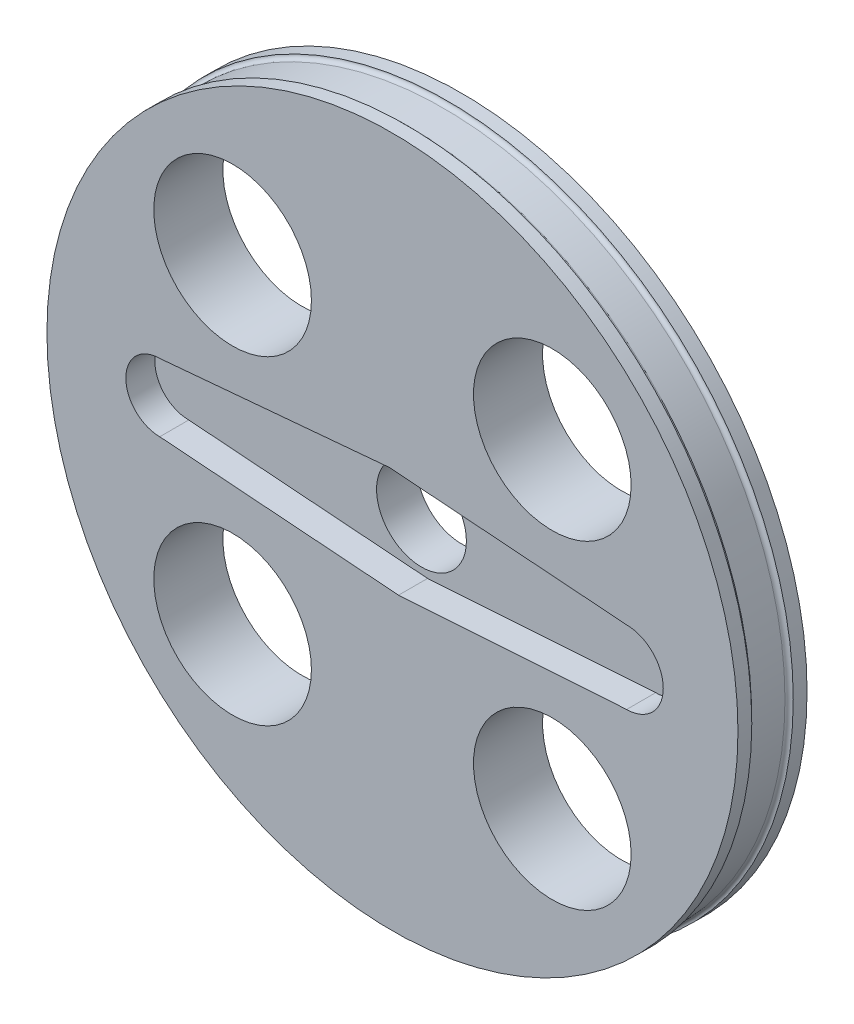
ISO-10303-21;
HEADER;
FILE_DESCRIPTION(('STEP AP214'),'2;1');
FILE_NAME('part.step','',(''),(''),'','','');
FILE_SCHEMA(('AUTOMOTIVE_DESIGN { 1 0 10303 214 1 1 1 1 }'));
ENDSEC;
DATA;
#1=APPLICATION_CONTEXT('core data for automotive mechanical design processes');
#2=APPLICATION_PROTOCOL_DEFINITION('international standard','automotive_design',2000,#1);
#3=PRODUCT_CONTEXT('',#1,'mechanical');
#4=PRODUCT('Part','Part','',(#3));
#5=PRODUCT_RELATED_PRODUCT_CATEGORY('part','',(#4));
#6=PRODUCT_DEFINITION_FORMATION('','',#4);
#7=PRODUCT_DEFINITION_CONTEXT('part definition',#1,'design');
#8=PRODUCT_DEFINITION('design','',#6,#7);
#9=PRODUCT_DEFINITION_SHAPE('','',#8);
#10=(LENGTH_UNIT() NAMED_UNIT(*) SI_UNIT(.MILLI.,.METRE.));
#11=(NAMED_UNIT(*) PLANE_ANGLE_UNIT() SI_UNIT($,.RADIAN.));
#12=(NAMED_UNIT(*) SI_UNIT($,.STERADIAN.) SOLID_ANGLE_UNIT());
#13=UNCERTAINTY_MEASURE_WITH_UNIT(LENGTH_MEASURE(1.E-05),#10,'distance_accuracy_value','');
#14=(GEOMETRIC_REPRESENTATION_CONTEXT(3) GLOBAL_UNCERTAINTY_ASSIGNED_CONTEXT((#13)) GLOBAL_UNIT_ASSIGNED_CONTEXT((#10,
#11,#12)) REPRESENTATION_CONTEXT('',''));
#15=CARTESIAN_POINT('',(0.,0.,0.));
#16=DIRECTION('',(0.,0.,1.));
#17=DIRECTION('',(1.,0.,0.));
#18=AXIS2_PLACEMENT_3D('',#15,#16,#17);
#19=CARTESIAN_POINT('',(-38.3080889759632,20.9098318993799,5.));
#20=DIRECTION('',(0.,0.,-1.));
#21=DIRECTION('',(-1.,0.,0.));
#22=AXIS2_PLACEMENT_3D('',#19,#20,#21);
#23=CYLINDRICAL_SURFACE('',#22,25.);
#24=CARTESIAN_POINT('',(-38.3080889759632,20.9098318993799,0.));
#25=DIRECTION('',(0.,0.,1.));
#26=DIRECTION('',(1.,0.,0.));
#27=AXIS2_PLACEMENT_3D('',#24,#25,#26);
#28=CIRCLE('',#27,25.);
#29=CARTESIAN_POINT('',(-13.3080889759632,20.9098318993799,0.));
#30=VERTEX_POINT('',#29);
#31=EDGE_CURVE('E147',#30,#30,#28,.T.);
#32=ORIENTED_EDGE('',*,*,#31,.T.);
#33=EDGE_LOOP('',(#32));
#34=FACE_BOUND('',#33,.T.);
#35=CARTESIAN_POINT('',(-38.3080889759632,20.9098318993799,1.));
#36=DIRECTION('',(0.,0.,-1.));
#37=DIRECTION('',(-1.,0.,0.));
#38=AXIS2_PLACEMENT_3D('',#35,#36,#37);
#39=CIRCLE('',#38,25.);
#40=CARTESIAN_POINT('',(-63.3080889759632,20.9098318993799,1.));
#41=VERTEX_POINT('',#40);
#42=EDGE_CURVE('E144',#41,#41,#39,.T.);
#43=ORIENTED_EDGE('',*,*,#42,.T.);
#44=EDGE_LOOP('',(#43));
#45=FACE_BOUND('',#44,.T.);
#46=ADVANCED_FACE('F33',(#34,#45),#23,.T.);
#47=CARTESIAN_POINT('',(-38.3080889759632,20.9098318993799,0.));
#48=DIRECTION('',(0.,0.,1.));
#49=DIRECTION('',(1.,0.,0.));
#50=AXIS2_PLACEMENT_3D('',#47,#48,#49);
#51=PLANE('',#50);
#52=CARTESIAN_POINT('',(-49.8736031515212,32.4753460749378,0.));
#53=DIRECTION('',(0.,0.,1.));
#54=DIRECTION('',(1.,0.,0.));
#55=AXIS2_PLACEMENT_3D('',#52,#53,#54);
#56=CIRCLE('',#55,5.70244776858911);
#57=CARTESIAN_POINT('',(-44.1711553829321,32.4753460749378,0.));
#58=VERTEX_POINT('',#57);
#59=EDGE_CURVE('E241',#58,#58,#56,.T.);
#60=ORIENTED_EDGE('',*,*,#59,.T.);
#61=EDGE_LOOP('',(#60));
#62=FACE_BOUND('',#61,.T.);
#63=CARTESIAN_POINT('',(-49.873603151521,9.34431772382153,0.));
#64=DIRECTION('',(0.,0.,1.));
#65=DIRECTION('',(1.,0.,0.));
#66=AXIS2_PLACEMENT_3D('',#63,#64,#65);
#67=CIRCLE('',#66,5.70244776858912);
#68=CARTESIAN_POINT('',(-44.1711553829319,9.34431772382153,0.));
#69=VERTEX_POINT('',#68);
#70=EDGE_CURVE('E245',#69,#69,#67,.T.);
#71=ORIENTED_EDGE('',*,*,#70,.T.);
#72=EDGE_LOOP('',(#71));
#73=FACE_BOUND('',#72,.T.);
#74=CARTESIAN_POINT('',(-26.7425748004048,9.34431772382177,0.));
#75=DIRECTION('',(0.,0.,1.));
#76=DIRECTION('',(1.,0.,0.));
#77=AXIS2_PLACEMENT_3D('',#74,#75,#76);
#78=CIRCLE('',#77,5.70244776858911);
#79=CARTESIAN_POINT('',(-21.0401270318156,9.34431772382177,0.));
#80=VERTEX_POINT('',#79);
#81=EDGE_CURVE('E254',#80,#80,#78,.T.);
#82=ORIENTED_EDGE('',*,*,#81,.T.);
#83=EDGE_LOOP('',(#82));
#84=FACE_BOUND('',#83,.T.);
#85=CARTESIAN_POINT('',(-26.7425748004051,32.475346074938,0.));
#86=DIRECTION('',(0.,0.,1.));
#87=DIRECTION('',(1.,0.,0.));
#88=AXIS2_PLACEMENT_3D('',#85,#86,#87);
#89=CIRCLE('',#88,5.70244776858911);
#90=CARTESIAN_POINT('',(-21.040127031816,32.475346074938,0.));
#91=VERTEX_POINT('',#90);
#92=EDGE_CURVE('E260',#91,#91,#89,.T.);
#93=ORIENTED_EDGE('',*,*,#92,.T.);
#94=EDGE_LOOP('',(#93));
#95=FACE_BOUND('',#94,.T.);
#96=CARTESIAN_POINT('',(-38.3080889759632,20.9098318993799,0.));
#97=DIRECTION('',(0.,0.,1.));
#98=DIRECTION('',(1.,0.,0.));
#99=AXIS2_PLACEMENT_3D('',#96,#97,#98);
#100=CIRCLE('',#99,3.25);
#101=CARTESIAN_POINT('',(-35.0580889759632,20.9098318993799,0.));
#102=VERTEX_POINT('',#101);
#103=EDGE_CURVE('E123',#102,#102,#100,.T.);
#104=ORIENTED_EDGE('',*,*,#103,.T.);
#105=EDGE_LOOP('',(#104));
#106=FACE_BOUND('',#105,.T.);
#107=ORIENTED_EDGE('',*,*,#31,.F.);
#108=EDGE_LOOP('',(#107));
#109=FACE_BOUND('',#108,.T.);
#110=ADVANCED_FACE('F164',(#62,#73,#84,#95,#106,#109),#51,.F.);
#111=CARTESIAN_POINT('',(-38.3080889759632,20.9098318993799,0.));
#112=DIRECTION('',(0.,0.,-1.));
#113=DIRECTION('',(-1.,0.,0.));
#114=AXIS2_PLACEMENT_3D('',#111,#112,#113);
#115=CYLINDRICAL_SURFACE('',#114,24.7);
#116=CARTESIAN_POINT('',(-38.3080889759632,20.9098318993799,3.7));
#117=DIRECTION('',(0.,0.,-1.));
#118=DIRECTION('',(-1.,0.,0.));
#119=AXIS2_PLACEMENT_3D('',#116,#117,#118);
#120=CIRCLE('',#119,24.7);
#121=CARTESIAN_POINT('',(-63.0080889759632,20.9098318993799,3.7));
#122=VERTEX_POINT('',#121);
#123=EDGE_CURVE('E11',#122,#122,#120,.T.);
#124=ORIENTED_EDGE('',*,*,#123,.T.);
#125=EDGE_LOOP('',(#124));
#126=FACE_BOUND('',#125,.T.);
#127=CARTESIAN_POINT('',(-38.3080889759632,20.9098318993799,1.3));
#128=DIRECTION('',(0.,0.,1.));
#129=DIRECTION('',(1.,0.,0.));
#130=AXIS2_PLACEMENT_3D('',#127,#128,#129);
#131=CIRCLE('',#130,24.7);
#132=CARTESIAN_POINT('',(-13.6080889759632,20.9098318993799,1.3));
#133=VERTEX_POINT('',#132);
#134=EDGE_CURVE('E41',#133,#133,#131,.T.);
#135=ORIENTED_EDGE('',*,*,#134,.T.);
#136=EDGE_LOOP('',(#135));
#137=FACE_BOUND('',#136,.T.);
#138=ADVANCED_FACE('F155',(#126,#137),#115,.T.);
#139=CARTESIAN_POINT('',(-38.3080889759632,20.9098318993799,5.));
#140=DIRECTION('',(0.,0.,1.));
#141=DIRECTION('',(1.,0.,0.));
#142=AXIS2_PLACEMENT_3D('',#139,#140,#141);
#143=PLANE('',#142);
#144=CARTESIAN_POINT('',(-49.8736031515212,32.4753460749378,5.));
#145=DIRECTION('',(0.,0.,1.));
#146=DIRECTION('',(1.,0.,0.));
#147=AXIS2_PLACEMENT_3D('',#144,#145,#146);
#148=CIRCLE('',#147,5.70244776858911);
#149=CARTESIAN_POINT('',(-44.1711553829321,32.4753460749378,5.));
#150=VERTEX_POINT('',#149);
#151=EDGE_CURVE('E238',#150,#150,#148,.T.);
#152=ORIENTED_EDGE('',*,*,#151,.F.);
#153=EDGE_LOOP('',(#152));
#154=FACE_BOUND('',#153,.T.);
#155=CARTESIAN_POINT('',(-49.873603151521,9.34431772382153,5.));
#156=DIRECTION('',(0.,0.,1.));
#157=DIRECTION('',(1.,0.,0.));
#158=AXIS2_PLACEMENT_3D('',#155,#156,#157);
#159=CIRCLE('',#158,5.70244776858912);
#160=CARTESIAN_POINT('',(-44.1711553829319,9.34431772382153,5.));
#161=VERTEX_POINT('',#160);
#162=EDGE_CURVE('E242',#161,#161,#159,.T.);
#163=ORIENTED_EDGE('',*,*,#162,.F.);
#164=EDGE_LOOP('',(#163));
#165=FACE_BOUND('',#164,.T.);
#166=CARTESIAN_POINT('',(-26.7425748004048,9.34431772382177,5.));
#167=DIRECTION('',(0.,0.,1.));
#168=DIRECTION('',(1.,0.,0.));
#169=AXIS2_PLACEMENT_3D('',#166,#167,#168);
#170=CIRCLE('',#169,5.70244776858911);
#171=CARTESIAN_POINT('',(-21.0401270318156,9.34431772382177,5.));
#172=VERTEX_POINT('',#171);
#173=EDGE_CURVE('E251',#172,#172,#170,.T.);
#174=ORIENTED_EDGE('',*,*,#173,.F.);
#175=EDGE_LOOP('',(#174));
#176=FACE_BOUND('',#175,.T.);
#177=CARTESIAN_POINT('',(-26.7425748004051,32.475346074938,5.));
#178=DIRECTION('',(0.,0.,1.));
#179=DIRECTION('',(1.,0.,0.));
#180=AXIS2_PLACEMENT_3D('',#177,#178,#179);
#181=CIRCLE('',#180,5.70244776858911);
#182=CARTESIAN_POINT('',(-21.040127031816,32.475346074938,5.));
#183=VERTEX_POINT('',#182);
#184=EDGE_CURVE('E257',#183,#183,#181,.T.);
#185=ORIENTED_EDGE('',*,*,#184,.F.);
#186=EDGE_LOOP('',(#185));
#187=FACE_BOUND('',#186,.T.);
#188=DIRECTION('',(-0.997236005662708,0.0742990512044924,0.));
#189=VECTOR('',#188,1.);
#190=CARTESIAN_POINT('',(-38.5378408043727,24.8394002818716,5.));
#191=LINE('',#190,#189);
#192=CARTESIAN_POINT('',(-21.3635748878897,23.5598318993799,5.));
#193=VERTEX_POINT('',#192);
#194=CARTESIAN_POINT('',(-38.5378408043727,24.8394002818716,5.));
#195=VERTEX_POINT('',#194);
#196=EDGE_CURVE('E48',#193,#195,#191,.T.);
#197=ORIENTED_EDGE('',*,*,#196,.F.);
#198=CARTESIAN_POINT('',(-21.3635748878897,20.9098318993799,5.));
#199=DIRECTION('',(0.,0.,1.));
#200=DIRECTION('',(1.,0.,0.));
#201=AXIS2_PLACEMENT_3D('',#198,#199,#200);
#202=CIRCLE('',#201,2.65);
#203=CARTESIAN_POINT('',(-21.3635748878897,18.2598318993799,5.));
#204=VERTEX_POINT('',#203);
#205=EDGE_CURVE('E132',#204,#193,#202,.T.);
#206=ORIENTED_EDGE('',*,*,#205,.F.);
#207=DIRECTION('',(0.997821412135131,0.0659729450960975,0.));
#208=VECTOR('',#207,1.);
#209=CARTESIAN_POINT('',(-37.8671567397895,17.1686647965668,5.));
#210=LINE('',#209,#208);
#211=CARTESIAN_POINT('',(-37.8671567397895,17.1686647965668,5.));
#212=VERTEX_POINT('',#211);
#213=EDGE_CURVE('E130',#212,#204,#210,.T.);
#214=ORIENTED_EDGE('',*,*,#213,.F.);
#215=DIRECTION('',(0.997236005662708,-0.0742990512044923,0.));
#216=VECTOR('',#215,1.);
#217=CARTESIAN_POINT('',(-37.8671567397895,17.1686647965668,5.));
#218=LINE('',#217,#216);
#219=CARTESIAN_POINT('',(-55.1454005986455,18.4559800538411,5.));
#220=VERTEX_POINT('',#219);
#221=EDGE_CURVE('E96',#220,#212,#218,.T.);
#222=ORIENTED_EDGE('',*,*,#221,.F.);
#223=CARTESIAN_POINT('',(-55.1454005986455,20.9098318993799,5.));
#224=DIRECTION('',(0.,0.,1.));
#225=DIRECTION('',(-1.,0.,0.));
#226=AXIS2_PLACEMENT_3D('',#223,#224,#225);
#227=CIRCLE('',#226,2.4538518455388);
#228=CARTESIAN_POINT('',(-55.1454005986455,23.3636837449187,5.));
#229=VERTEX_POINT('',#228);
#230=EDGE_CURVE('E126',#229,#220,#227,.T.);
#231=ORIENTED_EDGE('',*,*,#230,.F.);
#232=DIRECTION('',(-0.996075343172449,-0.0885093821235284,0.));
#233=VECTOR('',#232,1.);
#234=CARTESIAN_POINT('',(-38.5378408043727,24.8394002818716,5.));
#235=LINE('',#234,#233);
#236=EDGE_CURVE('E122',#195,#229,#235,.T.);
#237=ORIENTED_EDGE('',*,*,#236,.F.);
#238=EDGE_LOOP('',(#197,#206,#214,#222,#231,#237));
#239=FACE_BOUND('',#238,.T.);
#240=CARTESIAN_POINT('',(-38.3080889759632,20.9098318993799,5.));
#241=DIRECTION('',(0.,0.,1.));
#242=DIRECTION('',(1.,0.,0.));
#243=AXIS2_PLACEMENT_3D('',#240,#241,#242);
#244=CIRCLE('',#243,25.);
#245=CARTESIAN_POINT('',(-13.3080889759632,20.9098318993799,5.));
#246=VERTEX_POINT('',#245);
#247=EDGE_CURVE('E148',#246,#246,#244,.T.);
#248=ORIENTED_EDGE('',*,*,#247,.T.);
#249=EDGE_LOOP('',(#248));
#250=FACE_BOUND('',#249,.T.);
#251=ADVANCED_FACE('F174',(#154,#165,#176,#187,#239,#250),#143,.T.);
#252=ORIENTED_EDGE('',*,*,#247,.F.);
#253=EDGE_LOOP('',(#252));
#254=FACE_BOUND('',#253,.T.);
#255=CARTESIAN_POINT('',(-38.3080889759632,20.9098318993799,4.));
#256=DIRECTION('',(0.,0.,-1.));
#257=DIRECTION('',(-1.,0.,0.));
#258=AXIS2_PLACEMENT_3D('',#255,#256,#257);
#259=CIRCLE('',#258,25.);
#260=CARTESIAN_POINT('',(-63.3080889759632,20.9098318993799,4.));
#261=VERTEX_POINT('',#260);
#262=EDGE_CURVE('E136',#261,#261,#259,.T.);
#263=ORIENTED_EDGE('',*,*,#262,.F.);
#264=EDGE_LOOP('',(#263));
#265=FACE_BOUND('',#264,.T.);
#266=ADVANCED_FACE('F167',(#254,#265),#23,.T.);
#267=CARTESIAN_POINT('',(-38.3080889759632,20.9098318993799,3.7));
#268=DIRECTION('',(0.,0.,-1.));
#269=DIRECTION('',(-1.,0.,0.));
#270=AXIS2_PLACEMENT_3D('',#267,#268,#269);
#271=TOROIDAL_SURFACE('',#270,25.,0.3);
#272=ORIENTED_EDGE('',*,*,#262,.T.);
#273=EDGE_LOOP('',(#272));
#274=FACE_BOUND('',#273,.T.);
#275=ORIENTED_EDGE('',*,*,#123,.F.);
#276=EDGE_LOOP('',(#275));
#277=FACE_BOUND('',#276,.T.);
#278=ADVANCED_FACE('F160',(#274,#277),#271,.F.);
#279=CARTESIAN_POINT('',(-38.3080889759632,20.9098318993799,1.3));
#280=DIRECTION('',(0.,0.,1.));
#281=DIRECTION('',(1.,0.,0.));
#282=AXIS2_PLACEMENT_3D('',#279,#280,#281);
#283=TOROIDAL_SURFACE('',#282,25.,0.3);
#284=ORIENTED_EDGE('',*,*,#134,.F.);
#285=EDGE_LOOP('',(#284));
#286=FACE_BOUND('',#285,.T.);
#287=ORIENTED_EDGE('',*,*,#42,.F.);
#288=EDGE_LOOP('',(#287));
#289=FACE_BOUND('',#288,.T.);
#290=ADVANCED_FACE('F35',(#286,#289),#283,.F.);
#291=CARTESIAN_POINT('',(-38.5378408043727,24.8394002818716,2.9));
#292=DIRECTION('',(0.0742990512044924,0.997236005662708,0.));
#293=DIRECTION('',(-0.997236005662708,0.0742990512044924,0.));
#294=AXIS2_PLACEMENT_3D('',#291,#292,#293);
#295=PLANE('',#294);
#296=ORIENTED_EDGE('',*,*,#196,.T.);
#297=DIRECTION('',(0.,0.,1.));
#298=VECTOR('',#297,1.);
#299=CARTESIAN_POINT('',(-38.5378408043727,24.8394002818716,2.9));
#300=LINE('',#299,#298);
#301=CARTESIAN_POINT('',(-38.5378408043727,24.8394002818716,2.9));
#302=VERTEX_POINT('',#301);
#303=EDGE_CURVE('E78',#302,#195,#300,.T.);
#304=ORIENTED_EDGE('',*,*,#303,.F.);
#305=DIRECTION('',(-0.997236005662708,0.0742990512044924,0.));
#306=VECTOR('',#305,1.);
#307=CARTESIAN_POINT('',(-38.5378408043727,24.8394002818716,2.9));
#308=LINE('',#307,#306);
#309=CARTESIAN_POINT('',(-21.3635748878897,23.5598318993799,2.9));
#310=VERTEX_POINT('',#309);
#311=EDGE_CURVE('E134',#310,#302,#308,.T.);
#312=ORIENTED_EDGE('',*,*,#311,.F.);
#313=DIRECTION('',(0.,0.,1.));
#314=VECTOR('',#313,1.);
#315=CARTESIAN_POINT('',(-21.3635748878897,23.5598318993799,2.9));
#316=LINE('',#315,#314);
#317=EDGE_CURVE('E56',#310,#193,#316,.T.);
#318=ORIENTED_EDGE('',*,*,#317,.T.);
#319=EDGE_LOOP('',(#296,#304,#312,#318));
#320=FACE_BOUND('',#319,.T.);
#321=ADVANCED_FACE('F159',(#320),#295,.F.);
#322=CARTESIAN_POINT('',(-21.3635748878897,20.9098318993799,2.9));
#323=DIRECTION('',(0.,0.,1.));
#324=DIRECTION('',(1.,0.,0.));
#325=AXIS2_PLACEMENT_3D('',#322,#323,#324);
#326=CYLINDRICAL_SURFACE('',#325,2.65);
#327=ORIENTED_EDGE('',*,*,#205,.T.);
#328=ORIENTED_EDGE('',*,*,#317,.F.);
#329=CARTESIAN_POINT('',(-21.3635748878897,20.9098318993799,2.9));
#330=DIRECTION('',(0.,0.,1.));
#331=DIRECTION('',(1.,0.,0.));
#332=AXIS2_PLACEMENT_3D('',#329,#330,#331);
#333=CIRCLE('',#332,2.65);
#334=CARTESIAN_POINT('',(-21.3635748878897,18.2598318993799,2.9));
#335=VERTEX_POINT('',#334);
#336=EDGE_CURVE('E108',#335,#310,#333,.T.);
#337=ORIENTED_EDGE('',*,*,#336,.F.);
#338=DIRECTION('',(0.,0.,1.));
#339=VECTOR('',#338,1.);
#340=CARTESIAN_POINT('',(-21.3635748878897,18.2598318993799,2.9));
#341=LINE('',#340,#339);
#342=EDGE_CURVE('E100',#335,#204,#341,.T.);
#343=ORIENTED_EDGE('',*,*,#342,.T.);
#344=EDGE_LOOP('',(#327,#328,#337,#343));
#345=FACE_BOUND('',#344,.T.);
#346=ADVANCED_FACE('F196',(#345),#326,.F.);
#347=CARTESIAN_POINT('',(-37.8671567397895,17.1686647965668,2.9));
#348=DIRECTION('',(0.0659729450960975,-0.997821412135131,0.));
#349=DIRECTION('',(0.997821412135131,0.0659729450960975,0.));
#350=AXIS2_PLACEMENT_3D('',#347,#348,#349);
#351=PLANE('',#350);
#352=ORIENTED_EDGE('',*,*,#213,.T.);
#353=ORIENTED_EDGE('',*,*,#342,.F.);
#354=DIRECTION('',(0.997821412135131,0.0659729450960975,0.));
#355=VECTOR('',#354,1.);
#356=CARTESIAN_POINT('',(-37.8671567397895,17.1686647965668,2.9));
#357=LINE('',#356,#355);
#358=CARTESIAN_POINT('',(-37.8671567397895,17.1686647965668,2.9));
#359=VERTEX_POINT('',#358);
#360=EDGE_CURVE('E104',#359,#335,#357,.T.);
#361=ORIENTED_EDGE('',*,*,#360,.F.);
#362=DIRECTION('',(0.,0.,1.));
#363=VECTOR('',#362,1.);
#364=CARTESIAN_POINT('',(-37.8671567397895,17.1686647965668,2.9));
#365=LINE('',#364,#363);
#366=EDGE_CURVE('E89',#359,#212,#365,.T.);
#367=ORIENTED_EDGE('',*,*,#366,.T.);
#368=EDGE_LOOP('',(#352,#353,#361,#367));
#369=FACE_BOUND('',#368,.T.);
#370=ADVANCED_FACE('F105',(#369),#351,.F.);
#371=CARTESIAN_POINT('',(-37.8671567397895,17.1686647965668,2.9));
#372=DIRECTION('',(-0.0742990512044923,-0.997236005662708,0.));
#373=DIRECTION('',(0.997236005662708,-0.0742990512044923,0.));
#374=AXIS2_PLACEMENT_3D('',#371,#372,#373);
#375=PLANE('',#374);
#376=ORIENTED_EDGE('',*,*,#221,.T.);
#377=ORIENTED_EDGE('',*,*,#366,.F.);
#378=DIRECTION('',(0.997236005662708,-0.0742990512044923,0.));
#379=VECTOR('',#378,1.);
#380=CARTESIAN_POINT('',(-37.8671567397895,17.1686647965668,2.9));
#381=LINE('',#380,#379);
#382=CARTESIAN_POINT('',(-55.1454005986455,18.4559800538411,2.9));
#383=VERTEX_POINT('',#382);
#384=EDGE_CURVE('E93',#383,#359,#381,.T.);
#385=ORIENTED_EDGE('',*,*,#384,.F.);
#386=DIRECTION('',(0.,0.,1.));
#387=VECTOR('',#386,1.);
#388=CARTESIAN_POINT('',(-55.1454005986455,18.4559800538411,2.9));
#389=LINE('',#388,#387);
#390=EDGE_CURVE('E101',#383,#220,#389,.T.);
#391=ORIENTED_EDGE('',*,*,#390,.T.);
#392=EDGE_LOOP('',(#376,#377,#385,#391));
#393=FACE_BOUND('',#392,.T.);
#394=ADVANCED_FACE('F91',(#393),#375,.F.);
#395=CARTESIAN_POINT('',(-55.1454005986455,20.9098318993799,2.9));
#396=DIRECTION('',(0.,0.,1.));
#397=DIRECTION('',(1.,0.,0.));
#398=AXIS2_PLACEMENT_3D('',#395,#396,#397);
#399=CYLINDRICAL_SURFACE('',#398,2.4538518455388);
#400=ORIENTED_EDGE('',*,*,#230,.T.);
#401=ORIENTED_EDGE('',*,*,#390,.F.);
#402=CARTESIAN_POINT('',(-55.1454005986455,20.9098318993799,2.9));
#403=DIRECTION('',(0.,0.,1.));
#404=DIRECTION('',(-1.,0.,0.));
#405=AXIS2_PLACEMENT_3D('',#402,#403,#404);
#406=CIRCLE('',#405,2.4538518455388);
#407=CARTESIAN_POINT('',(-55.1454005986455,23.3636837449187,2.9));
#408=VERTEX_POINT('',#407);
#409=EDGE_CURVE('E114',#408,#383,#406,.T.);
#410=ORIENTED_EDGE('',*,*,#409,.F.);
#411=DIRECTION('',(0.,0.,1.));
#412=VECTOR('',#411,1.);
#413=CARTESIAN_POINT('',(-55.1454005986455,23.3636837449187,2.9));
#414=LINE('',#413,#412);
#415=EDGE_CURVE('E139',#408,#229,#414,.T.);
#416=ORIENTED_EDGE('',*,*,#415,.T.);
#417=EDGE_LOOP('',(#400,#401,#410,#416));
#418=FACE_BOUND('',#417,.T.);
#419=ADVANCED_FACE('F200',(#418),#399,.F.);
#420=CARTESIAN_POINT('',(-38.5378408043727,24.8394002818716,2.9));
#421=DIRECTION('',(-0.0885093821235284,0.996075343172449,0.));
#422=DIRECTION('',(-0.996075343172449,-0.0885093821235284,0.));
#423=AXIS2_PLACEMENT_3D('',#420,#421,#422);
#424=PLANE('',#423);
#425=ORIENTED_EDGE('',*,*,#236,.T.);
#426=ORIENTED_EDGE('',*,*,#415,.F.);
#427=DIRECTION('',(-0.996075343172449,-0.0885093821235284,0.));
#428=VECTOR('',#427,1.);
#429=CARTESIAN_POINT('',(-38.5378408043727,24.8394002818716,2.9));
#430=LINE('',#429,#428);
#431=EDGE_CURVE('E116',#302,#408,#430,.T.);
#432=ORIENTED_EDGE('',*,*,#431,.F.);
#433=ORIENTED_EDGE('',*,*,#303,.T.);
#434=EDGE_LOOP('',(#425,#426,#432,#433));
#435=FACE_BOUND('',#434,.T.);
#436=ADVANCED_FACE('F197',(#435),#424,.F.);
#437=CARTESIAN_POINT('',(-21.3635748878897,20.9098318993799,2.9));
#438=DIRECTION('',(0.,0.,1.));
#439=DIRECTION('',(1.,0.,0.));
#440=AXIS2_PLACEMENT_3D('',#437,#438,#439);
#441=PLANE('',#440);
#442=CARTESIAN_POINT('',(-38.3080889759632,20.9098318993799,2.9));
#443=DIRECTION('',(0.,0.,1.));
#444=DIRECTION('',(1.,0.,0.));
#445=AXIS2_PLACEMENT_3D('',#442,#443,#444);
#446=CIRCLE('',#445,3.25);
#447=CARTESIAN_POINT('',(-35.0580889759632,20.9098318993799,2.9));
#448=VERTEX_POINT('',#447);
#449=EDGE_CURVE('E263',#448,#448,#446,.T.);
#450=ORIENTED_EDGE('',*,*,#449,.F.);
#451=EDGE_LOOP('',(#450));
#452=FACE_BOUND('',#451,.T.);
#453=ORIENTED_EDGE('',*,*,#311,.T.);
#454=ORIENTED_EDGE('',*,*,#431,.T.);
#455=ORIENTED_EDGE('',*,*,#409,.T.);
#456=ORIENTED_EDGE('',*,*,#384,.T.);
#457=ORIENTED_EDGE('',*,*,#360,.T.);
#458=ORIENTED_EDGE('',*,*,#336,.T.);
#459=EDGE_LOOP('',(#453,#454,#455,#456,#457,#458));
#460=FACE_BOUND('',#459,.T.);
#461=ADVANCED_FACE('F111',(#452,#460),#441,.T.);
#462=CARTESIAN_POINT('',(-38.3080889759632,20.9098318993799,-7.2));
#463=DIRECTION('',(0.,0.,1.));
#464=DIRECTION('',(1.,0.,0.));
#465=AXIS2_PLACEMENT_3D('',#462,#463,#464);
#466=CYLINDRICAL_SURFACE('',#465,3.25);
#467=ORIENTED_EDGE('',*,*,#449,.T.);
#468=EDGE_LOOP('',(#467));
#469=FACE_BOUND('',#468,.T.);
#470=ORIENTED_EDGE('',*,*,#103,.F.);
#471=EDGE_LOOP('',(#470));
#472=FACE_BOUND('',#471,.T.);
#473=ADVANCED_FACE('F213',(#469,#472),#466,.F.);
#474=CARTESIAN_POINT('',(-26.7425748004051,32.475346074938,-5.1));
#475=DIRECTION('',(0.,0.,1.));
#476=DIRECTION('',(1.,0.,0.));
#477=AXIS2_PLACEMENT_3D('',#474,#475,#476);
#478=CYLINDRICAL_SURFACE('',#477,5.70244776858911);
#479=ORIENTED_EDGE('',*,*,#184,.T.);
#480=EDGE_LOOP('',(#479));
#481=FACE_BOUND('',#480,.T.);
#482=ORIENTED_EDGE('',*,*,#92,.F.);
#483=EDGE_LOOP('',(#482));
#484=FACE_BOUND('',#483,.T.);
#485=ADVANCED_FACE('F217',(#481,#484),#478,.F.);
#486=CARTESIAN_POINT('',(-26.7425748004048,9.34431772382177,-5.1));
#487=DIRECTION('',(0.,0.,1.));
#488=DIRECTION('',(1.,0.,0.));
#489=AXIS2_PLACEMENT_3D('',#486,#487,#488);
#490=CYLINDRICAL_SURFACE('',#489,5.70244776858911);
#491=ORIENTED_EDGE('',*,*,#173,.T.);
#492=EDGE_LOOP('',(#491));
#493=FACE_BOUND('',#492,.T.);
#494=ORIENTED_EDGE('',*,*,#81,.F.);
#495=EDGE_LOOP('',(#494));
#496=FACE_BOUND('',#495,.T.);
#497=ADVANCED_FACE('F221',(#493,#496),#490,.F.);
#498=CARTESIAN_POINT('',(-49.873603151521,9.34431772382153,-5.1));
#499=DIRECTION('',(0.,0.,1.));
#500=DIRECTION('',(1.,0.,0.));
#501=AXIS2_PLACEMENT_3D('',#498,#499,#500);
#502=CYLINDRICAL_SURFACE('',#501,5.70244776858912);
#503=ORIENTED_EDGE('',*,*,#162,.T.);
#504=EDGE_LOOP('',(#503));
#505=FACE_BOUND('',#504,.T.);
#506=ORIENTED_EDGE('',*,*,#70,.F.);
#507=EDGE_LOOP('',(#506));
#508=FACE_BOUND('',#507,.T.);
#509=ADVANCED_FACE('F225',(#505,#508),#502,.F.);
#510=CARTESIAN_POINT('',(-49.8736031515212,32.4753460749378,-5.1));
#511=DIRECTION('',(0.,0.,1.));
#512=DIRECTION('',(1.,0.,0.));
#513=AXIS2_PLACEMENT_3D('',#510,#511,#512);
#514=CYLINDRICAL_SURFACE('',#513,5.70244776858911);
#515=ORIENTED_EDGE('',*,*,#151,.T.);
#516=EDGE_LOOP('',(#515));
#517=FACE_BOUND('',#516,.T.);
#518=ORIENTED_EDGE('',*,*,#59,.F.);
#519=EDGE_LOOP('',(#518));
#520=FACE_BOUND('',#519,.T.);
#521=ADVANCED_FACE('F229',(#517,#520),#514,.F.);
#522=CLOSED_SHELL('',(#46,#110,#138,#251,#266,#278,#290,#321,#346,#370,#394,#419,#436,#461,#473,
#485,#497,#509,#521));
#523=MANIFOLD_SOLID_BREP('B2',#522);
#524=ADVANCED_BREP_SHAPE_REPRESENTATION('',(#18,#523),#14);
#525=SHAPE_DEFINITION_REPRESENTATION(#9,#524);
ENDSEC;
END-ISO-10303-21;
